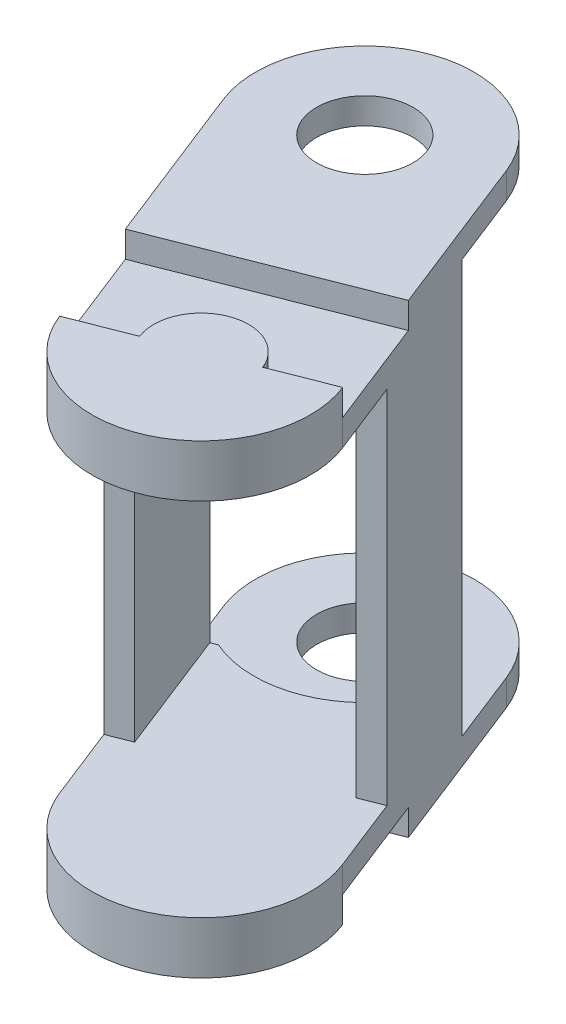
ISO-10303-21;
HEADER;
FILE_DESCRIPTION(('STEP AP214'),'2;1');
FILE_NAME('part.step','',(''),(''),'','','');
FILE_SCHEMA(('AUTOMOTIVE_DESIGN { 1 0 10303 214 1 1 1 1 }'));
ENDSEC;
DATA;
#1=APPLICATION_CONTEXT('core data for automotive mechanical design processes');
#2=APPLICATION_PROTOCOL_DEFINITION('international standard','automotive_design',2000,#1);
#3=PRODUCT_CONTEXT('',#1,'mechanical');
#4=PRODUCT('Part','Part','',(#3));
#5=PRODUCT_RELATED_PRODUCT_CATEGORY('part','',(#4));
#6=PRODUCT_DEFINITION_FORMATION('','',#4);
#7=PRODUCT_DEFINITION_CONTEXT('part definition',#1,'design');
#8=PRODUCT_DEFINITION('design','',#6,#7);
#9=PRODUCT_DEFINITION_SHAPE('','',#8);
#10=(LENGTH_UNIT() NAMED_UNIT(*) SI_UNIT(.MILLI.,.METRE.));
#11=(NAMED_UNIT(*) PLANE_ANGLE_UNIT() SI_UNIT($,.RADIAN.));
#12=(NAMED_UNIT(*) SI_UNIT($,.STERADIAN.) SOLID_ANGLE_UNIT());
#13=UNCERTAINTY_MEASURE_WITH_UNIT(LENGTH_MEASURE(1.E-05),#10,'distance_accuracy_value','');
#14=(GEOMETRIC_REPRESENTATION_CONTEXT(3) GLOBAL_UNCERTAINTY_ASSIGNED_CONTEXT((#13)) GLOBAL_UNIT_ASSIGNED_CONTEXT((#10,
#11,#12)) REPRESENTATION_CONTEXT('',''));
#15=CARTESIAN_POINT('',(0.,0.,0.));
#16=DIRECTION('',(0.,0.,1.));
#17=DIRECTION('',(1.,0.,0.));
#18=AXIS2_PLACEMENT_3D('',#15,#16,#17);
#19=CARTESIAN_POINT('',(-184.265930697306,43.5,61.1855100411605));
#20=DIRECTION('',(0.365652358002226,0.,0.930751499105648));
#21=DIRECTION('',(0.930751499105649,0.,-0.365652358002226));
#22=AXIS2_PLACEMENT_3D('',#19,#20,#21);
#23=PLANE('',#22);
#24=DIRECTION('',(0.930751499105648,0.,-0.365652358002226));
#25=VECTOR('',#24,1.);
#26=CARTESIAN_POINT('',(-184.265930697306,40.75,61.1855100411605));
#27=LINE('',#26,#25);
#28=CARTESIAN_POINT('',(-156.074627033272,40.75,50.1103555344892));
#29=VERTEX_POINT('',#28);
#30=CARTESIAN_POINT('',(-150.024742289085,40.75,47.7336152074748));
#31=VERTEX_POINT('',#30);
#32=EDGE_CURVE('E271',#29,#31,#27,.T.);
#33=ORIENTED_EDGE('',*,*,#32,.F.);
#34=DIRECTION('',(0.,1.,0.));
#35=VECTOR('',#34,1.);
#36=CARTESIAN_POINT('',(-156.074627033272,40.75,50.1103555344892));
#37=LINE('',#36,#35);
#38=CARTESIAN_POINT('',(-156.074627033272,43.5,50.1103555344892));
#39=VERTEX_POINT('',#38);
#40=EDGE_CURVE('E65',#29,#39,#37,.T.);
#41=ORIENTED_EDGE('',*,*,#40,.T.);
#42=DIRECTION('',(-0.930751499105649,0.,0.365652358002226));
#43=VECTOR('',#42,1.);
#44=CARTESIAN_POINT('',(-160.728384528823,43.5,51.9386173245095));
#45=LINE('',#44,#43);
#46=CARTESIAN_POINT('',(-150.024742289085,43.5,47.7336152074748));
#47=VERTEX_POINT('',#46);
#48=EDGE_CURVE('E12',#47,#39,#45,.T.);
#49=ORIENTED_EDGE('',*,*,#48,.F.);
#50=DIRECTION('',(0.,-1.,0.));
#51=VECTOR('',#50,1.);
#52=CARTESIAN_POINT('',(-150.024742289085,43.5,47.7336152074748));
#53=LINE('',#52,#51);
#54=EDGE_CURVE('E1078',#47,#31,#53,.T.);
#55=ORIENTED_EDGE('',*,*,#54,.T.);
#56=EDGE_LOOP('',(#33,#41,#49,#55));
#57=FACE_BOUND('',#56,.T.);
#58=ADVANCED_FACE('F50',(#57),#23,.F.);
#59=CARTESIAN_POINT('',(-184.265930697343,-2.75,61.1855100410671));
#60=DIRECTION('',(0.365652358002226,0.,0.930751499105649));
#61=DIRECTION('',(0.930751499105649,0.,-0.365652358002226));
#62=AXIS2_PLACEMENT_3D('',#59,#60,#61);
#63=PLANE('',#62);
#64=DIRECTION('',(0.930751499105649,0.,-0.365652358002226));
#65=VECTOR('',#64,1.);
#66=CARTESIAN_POINT('',(-160.728384528813,-5.5,51.9386173243977));
#67=LINE('',#66,#65);
#68=CARTESIAN_POINT('',(-156.074627033308,-5.5,50.1103555343957));
#69=VERTEX_POINT('',#68);
#70=CARTESIAN_POINT('',(-150.024742289129,-5.5,47.7336152073636));
#71=VERTEX_POINT('',#70);
#72=EDGE_CURVE('E451',#69,#71,#67,.T.);
#73=ORIENTED_EDGE('',*,*,#72,.F.);
#74=DIRECTION('',(0.,1.,0.));
#75=VECTOR('',#74,1.);
#76=CARTESIAN_POINT('',(-156.074627033308,-5.5,50.1103555343957));
#77=LINE('',#76,#75);
#78=CARTESIAN_POINT('',(-156.074627033308,-2.75,50.1103555343957));
#79=VERTEX_POINT('',#78);
#80=EDGE_CURVE('E1084',#69,#79,#77,.T.);
#81=ORIENTED_EDGE('',*,*,#80,.T.);
#82=DIRECTION('',(0.930751499105649,0.,-0.365652358002226));
#83=VECTOR('',#82,1.);
#84=CARTESIAN_POINT('',(-184.265930697343,-2.75,61.1855100410671));
#85=LINE('',#84,#83);
#86=CARTESIAN_POINT('',(-150.024742289122,-2.75,47.7336152073813));
#87=VERTEX_POINT('',#86);
#88=EDGE_CURVE('E294',#79,#87,#85,.T.);
#89=ORIENTED_EDGE('',*,*,#88,.T.);
#90=DIRECTION('',(0.,1.,0.));
#91=VECTOR('',#90,1.);
#92=CARTESIAN_POINT('',(-150.024742289222,-2.75,47.7336152074002));
#93=LINE('',#92,#91);
#94=EDGE_CURVE('E423',#71,#87,#93,.T.);
#95=ORIENTED_EDGE('',*,*,#94,.F.);
#96=EDGE_LOOP('',(#73,#81,#89,#95));
#97=FACE_BOUND('',#96,.T.);
#98=ADVANCED_FACE('F1148',(#97),#63,.F.);
#99=CARTESIAN_POINT('',(-160.72838452886,43.5,51.938617324416));
#100=DIRECTION('',(0.,-1.,0.));
#101=DIRECTION('',(0.,0.,-1.));
#102=AXIS2_PLACEMENT_3D('',#99,#100,#101);
#103=PLANE('',#102);
#104=ORIENTED_EDGE('',*,*,#48,.T.);
#105=CARTESIAN_POINT('',(-160.7283845288,43.5,51.9386173245));
#106=DIRECTION('',(0.,1.,0.));
#107=DIRECTION('',(0.,0.,1.));
#108=AXIS2_PLACEMENT_3D('',#105,#106,#107);
#109=CIRCLE('',#108,5.);
#110=CARTESIAN_POINT('',(-165.382142024328,43.5,53.7668791145114));
#111=VERTEX_POINT('',#110);
#112=EDGE_CURVE('E256',#39,#111,#109,.T.);
#113=ORIENTED_EDGE('',*,*,#112,.T.);
#114=CARTESIAN_POINT('',(-171.432026768515,43.5,56.143619441526));
#115=VERTEX_POINT('',#114);
#116=EDGE_CURVE('E58',#111,#115,#45,.T.);
#117=ORIENTED_EDGE('',*,*,#116,.T.);
#118=CARTESIAN_POINT('',(-160.72838452886,43.5,51.938617324416));
#119=DIRECTION('',(0.,1.,0.));
#120=DIRECTION('',(0.,0.,-1.));
#121=AXIS2_PLACEMENT_3D('',#118,#119,#120);
#122=CIRCLE('',#121,11.499999999975);
#123=EDGE_CURVE('E427',#115,#47,#122,.T.);
#124=ORIENTED_EDGE('',*,*,#123,.T.);
#125=EDGE_LOOP('',(#104,#113,#117,#124));
#126=FACE_BOUND('',#125,.T.);
#127=ADVANCED_FACE('F1070',(#126),#103,.F.);
#128=CARTESIAN_POINT('',(-160.72838452882,-5.5,51.9386173243801));
#129=DIRECTION('',(0.,1.,0.));
#130=DIRECTION('',(0.,0.,1.));
#131=AXIS2_PLACEMENT_3D('',#128,#129,#130);
#132=PLANE('',#131);
#133=CARTESIAN_POINT('',(-171.8807814485,-5.5,23.5506966021));
#134=DIRECTION('',(0.,-1.,0.));
#135=DIRECTION('',(0.,0.,-1.));
#136=AXIS2_PLACEMENT_3D('',#133,#134,#135);
#137=CIRCLE('',#136,5.07500000000002);
#138=CARTESIAN_POINT('',(-171.8807814485,-5.5,18.4756966021));
#139=VERTEX_POINT('',#138);
#140=EDGE_CURVE('E1640',#139,#139,#137,.T.);
#141=ORIENTED_EDGE('',*,*,#140,.F.);
#142=EDGE_LOOP('',(#141));
#143=FACE_BOUND('',#142,.T.);
#144=DIRECTION('',(0.365652358002226,0.,0.930751499105648));
#145=VECTOR('',#144,1.);
#146=CARTESIAN_POINT('',(-150.024742289129,-5.5,47.7336152073636));
#147=LINE('',#146,#145);
#148=CARTESIAN_POINT('',(-161.177139208116,-5.5,19.3456944848454));
#149=VERTEX_POINT('',#148);
#150=CARTESIAN_POINT('',(-154.503983674491,-5.5,36.3319093437392));
#151=VERTEX_POINT('',#150);
#152=EDGE_CURVE('E317',#149,#151,#147,.T.);
#153=ORIENTED_EDGE('',*,*,#152,.T.);
#154=DIRECTION('',(-0.930751499105649,0.,0.365652358002226));
#155=VECTOR('',#154,1.);
#156=CARTESIAN_POINT('',(-165.207625914183,-5.5,40.5369114607557));
#157=LINE('',#156,#155);
#158=CARTESIAN_POINT('',(-175.911268153856,-5.5,44.7419135777648));
#159=VERTEX_POINT('',#158);
#160=EDGE_CURVE('E1063',#151,#159,#157,.T.);
#161=ORIENTED_EDGE('',*,*,#160,.T.);
#162=DIRECTION('',(-0.365652358000698,0.,-0.930751499106249));
#163=VECTOR('',#162,1.);
#164=CARTESIAN_POINT('',(-182.58442368746,-5.5,27.7556987188424));
#165=LINE('',#164,#163);
#166=CARTESIAN_POINT('',(-182.58442368746,-5.5,27.7556987188424));
#167=VERTEX_POINT('',#166);
#168=EDGE_CURVE('E312',#159,#167,#165,.T.);
#169=ORIENTED_EDGE('',*,*,#168,.T.);
#170=CARTESIAN_POINT('',(-171.880781447785,-5.5,23.5506966018527));
#171=DIRECTION('',(0.,-1.,0.));
#172=DIRECTION('',(0.,0.,1.));
#173=AXIS2_PLACEMENT_3D('',#170,#171,#172);
#174=CIRCLE('',#173,11.49999999995);
#175=EDGE_CURVE('E315',#167,#149,#174,.T.);
#176=ORIENTED_EDGE('',*,*,#175,.T.);
#177=EDGE_LOOP('',(#153,#161,#169,#176));
#178=FACE_BOUND('',#177,.T.);
#179=ADVANCED_FACE('F1140',(#143,#178),#132,.F.);
#180=CARTESIAN_POINT('',(-11.9490681605092,0.,-30.4158112478024));
#181=DIRECTION('',(-0.365652358002225,0.,-0.930751499105649));
#182=DIRECTION('',(-0.930751499105649,0.,0.365652358002225));
#183=AXIS2_PLACEMENT_3D('',#180,#181,#182);
#184=PLANE('',#183);
#185=DIRECTION('',(0.,1.,0.));
#186=VECTOR('',#185,1.);
#187=CARTESIAN_POINT('',(-176.585881805809,-2.75,34.2629340254768));
#188=LINE('',#187,#186);
#189=CARTESIAN_POINT('',(-176.585881805809,-2.75,34.2629340254768));
#190=VERTEX_POINT('',#189);
#191=CARTESIAN_POINT('',(-176.585881805809,0.,34.2629340254768));
#192=VERTEX_POINT('',#191);
#193=EDGE_CURVE('E304',#190,#192,#188,.T.);
#194=ORIENTED_EDGE('',*,*,#193,.F.);
#195=DIRECTION('',(-0.930751499105649,0.,0.365652358002225));
#196=VECTOR('',#195,1.);
#197=CARTESIAN_POINT('',(-158.160507254501,-2.75,27.0243943527135));
#198=LINE('',#197,#196);
#199=CARTESIAN_POINT('',(-179.567791733931,-2.75,35.4343985867648));
#200=VERTEX_POINT('',#199);
#201=EDGE_CURVE('E396',#190,#200,#198,.T.);
#202=ORIENTED_EDGE('',*,*,#201,.T.);
#203=DIRECTION('',(0.,1.,0.));
#204=VECTOR('',#203,1.);
#205=CARTESIAN_POINT('',(-179.567791733931,-2.75,35.4343985867648));
#206=LINE('',#205,#204);
#207=CARTESIAN_POINT('',(-179.567791733931,40.75,35.4343985867648));
#208=VERTEX_POINT('',#207);
#209=EDGE_CURVE('E402',#200,#208,#206,.T.);
#210=ORIENTED_EDGE('',*,*,#209,.T.);
#211=DIRECTION('',(0.930751499105649,0.,-0.365652358002225));
#212=VECTOR('',#211,1.);
#213=CARTESIAN_POINT('',(-179.567791733931,40.75,35.4343985867648));
#214=LINE('',#213,#212);
#215=CARTESIAN_POINT('',(-176.585881805809,40.75,34.2629340254766));
#216=VERTEX_POINT('',#215);
#217=EDGE_CURVE('E406',#208,#216,#214,.T.);
#218=ORIENTED_EDGE('',*,*,#217,.T.);
#219=DIRECTION('',(0.,1.,0.));
#220=VECTOR('',#219,1.);
#221=CARTESIAN_POINT('',(-176.585881805809,38.,34.2629340254768));
#222=LINE('',#221,#220);
#223=CARTESIAN_POINT('',(-176.585881805809,38.0000000000003,34.2629340254769));
#224=VERTEX_POINT('',#223);
#225=EDGE_CURVE('E393',#224,#216,#222,.T.);
#226=ORIENTED_EDGE('',*,*,#225,.F.);
#227=DIRECTION('',(0.930751499105649,0.,-0.365652358002225));
#228=VECTOR('',#227,1.);
#229=CARTESIAN_POINT('',(-177.240912986167,38.0000000000003,34.5202676917593));
#230=LINE('',#229,#228);
#231=CARTESIAN_POINT('',(-177.240912986167,38.0000000000003,34.5202676917593));
#232=VERTEX_POINT('',#231);
#233=EDGE_CURVE('E355',#232,#224,#230,.T.);
#234=ORIENTED_EDGE('',*,*,#233,.F.);
#235=DIRECTION('',(0.,1.,0.));
#236=VECTOR('',#235,1.);
#237=CARTESIAN_POINT('',(-177.240912986166,2.74925928360182E-13,34.5202676917592));
#238=LINE('',#237,#236);
#239=CARTESIAN_POINT('',(-177.240912986166,2.74925928360182E-13,34.5202676917592));
#240=VERTEX_POINT('',#239);
#241=EDGE_CURVE('E347',#240,#232,#238,.T.);
#242=ORIENTED_EDGE('',*,*,#241,.F.);
#243=DIRECTION('',(0.930751499105649,0.,-0.365652358002226));
#244=VECTOR('',#243,1.);
#245=CARTESIAN_POINT('',(-176.585881805809,0.,34.2629340254767));
#246=LINE('',#245,#244);
#247=EDGE_CURVE('E384',#240,#192,#246,.T.);
#248=ORIENTED_EDGE('',*,*,#247,.T.);
#249=EDGE_LOOP('',(#194,#202,#210,#218,#226,#234,#242,#248));
#250=FACE_BOUND('',#249,.T.);
#251=ADVANCED_FACE('F1209',(#250),#184,.T.);
#252=CARTESIAN_POINT('',(-6.82993515371631,0.,-17.3852902704244));
#253=DIRECTION('',(0.365652358061123,0.,0.93075149908251));
#254=DIRECTION('',(0.93075149908251,0.,-0.365652358061123));
#255=AXIS2_PLACEMENT_3D('',#252,#253,#254);
#256=PLANE('',#255);
#257=DIRECTION('',(-0.93075149908251,0.,0.365652358061123));
#258=VECTOR('',#257,1.);
#259=CARTESIAN_POINT('',(-153.041374243652,38.,40.0549153391781));
#260=LINE('',#259,#258);
#261=CARTESIAN_POINT('',(-153.041374243652,38.,40.0549153391781));
#262=VERTEX_POINT('',#261);
#263=CARTESIAN_POINT('',(-155.368252990242,38.0000000000002,40.9690462351789));
#264=VERTEX_POINT('',#263);
#265=EDGE_CURVE('E373',#262,#264,#260,.T.);
#266=ORIENTED_EDGE('',*,*,#265,.T.);
#267=DIRECTION('',(0.,1.,0.));
#268=VECTOR('',#267,1.);
#269=CARTESIAN_POINT('',(-155.368252990242,2.51062781034005E-13,40.9690462351788));
#270=LINE('',#269,#268);
#271=CARTESIAN_POINT('',(-155.36825299068,0.,40.9690462340644));
#272=VERTEX_POINT('',#271);
#273=EDGE_CURVE('E339',#272,#264,#270,.T.);
#274=ORIENTED_EDGE('',*,*,#273,.F.);
#275=DIRECTION('',(0.93075149908251,0.,-0.365652358061123));
#276=VECTOR('',#275,1.);
#277=CARTESIAN_POINT('',(-156.023284171507,0.,41.2263799005793));
#278=LINE('',#277,#276);
#279=CARTESIAN_POINT('',(-153.041374243652,0.,40.0549153391781));
#280=VERTEX_POINT('',#279);
#281=EDGE_CURVE('E376',#272,#280,#278,.T.);
#282=ORIENTED_EDGE('',*,*,#281,.T.);
#283=DIRECTION('',(0.,1.,0.));
#284=VECTOR('',#283,1.);
#285=CARTESIAN_POINT('',(-153.041374243652,0.,40.0549153391781));
#286=LINE('',#285,#284);
#287=EDGE_CURVE('E368',#280,#262,#286,.T.);
#288=ORIENTED_EDGE('',*,*,#287,.T.);
#289=EDGE_LOOP('',(#266,#274,#282,#288));
#290=FACE_BOUND('',#289,.T.);
#291=ADVANCED_FACE('F1205',(#290),#256,.T.);
#292=CARTESIAN_POINT('',(-6.82993515375245,0.,-17.3852902705165));
#293=DIRECTION('',(0.36565235806112,0.,0.930751499082512));
#294=DIRECTION('',(0.930751499082512,0.,-0.36565235806112));
#295=AXIS2_PLACEMENT_3D('',#292,#293,#294);
#296=PLANE('',#295);
#297=DIRECTION('',(0.930751499082512,0.,-0.36565235806112));
#298=VECTOR('',#297,1.);
#299=CARTESIAN_POINT('',(-174.448658722586,0.,48.4649195744912));
#300=LINE('',#299,#298);
#301=CARTESIAN_POINT('',(-174.448658722586,0.,48.4649195744912));
#302=VERTEX_POINT('',#301);
#303=CARTESIAN_POINT('',(-172.121779974143,2.74925928360181E-13,47.550788679219));
#304=VERTEX_POINT('',#303);
#305=EDGE_CURVE('E360',#302,#304,#300,.T.);
#306=ORIENTED_EDGE('',*,*,#305,.T.);
#307=DIRECTION('',(0.,-1.,0.));
#308=VECTOR('',#307,1.);
#309=CARTESIAN_POINT('',(-172.121779974143,38.0000000000003,47.550788679219));
#310=LINE('',#309,#308);
#311=CARTESIAN_POINT('',(-172.121779974201,38.,47.5507886790717));
#312=VERTEX_POINT('',#311);
#313=EDGE_CURVE('E352',#312,#304,#310,.T.);
#314=ORIENTED_EDGE('',*,*,#313,.F.);
#315=DIRECTION('',(-0.930751499082512,0.,0.36565235806112));
#316=VECTOR('',#315,1.);
#317=CARTESIAN_POINT('',(-171.466748794345,38.,47.2934550129388));
#318=LINE('',#317,#316);
#319=CARTESIAN_POINT('',(-174.448658722586,38.,48.4649195744912));
#320=VERTEX_POINT('',#319);
#321=EDGE_CURVE('E363',#312,#320,#318,.T.);
#322=ORIENTED_EDGE('',*,*,#321,.T.);
#323=DIRECTION('',(0.,-1.,0.));
#324=VECTOR('',#323,1.);
#325=CARTESIAN_POINT('',(-174.448658722586,38.,48.4649195744912));
#326=LINE('',#325,#324);
#327=EDGE_CURVE('E357',#320,#302,#326,.T.);
#328=ORIENTED_EDGE('',*,*,#327,.T.);
#329=EDGE_LOOP('',(#306,#314,#322,#328));
#330=FACE_BOUND('',#329,.T.);
#331=ADVANCED_FACE('F1201',(#330),#296,.T.);
#332=DIRECTION('',(0.,1.,0.));
#333=VECTOR('',#332,1.);
#334=CARTESIAN_POINT('',(-161.142417182623,-2.75,28.1958589140017));
#335=LINE('',#334,#333);
#336=CARTESIAN_POINT('',(-161.142417182623,-2.75,28.1958589140016));
#337=VERTEX_POINT('',#336);
#338=CARTESIAN_POINT('',(-161.142417182623,0.,28.1958589140017));
#339=VERTEX_POINT('',#338);
#340=EDGE_CURVE('E302',#337,#339,#335,.T.);
#341=ORIENTED_EDGE('',*,*,#340,.T.);
#342=CARTESIAN_POINT('',(-160.487386002265,2.51062781034004E-13,27.9385252477194));
#343=VERTEX_POINT('',#342);
#344=EDGE_CURVE('E382',#339,#343,#246,.T.);
#345=ORIENTED_EDGE('',*,*,#344,.T.);
#346=DIRECTION('',(0.,-1.,0.));
#347=VECTOR('',#346,1.);
#348=CARTESIAN_POINT('',(-160.487386002265,38.0000000000002,27.9385252477194));
#349=LINE('',#348,#347);
#350=CARTESIAN_POINT('',(-160.487386002265,38.0000000000002,27.9385252477194));
#351=VERTEX_POINT('',#350);
#352=EDGE_CURVE('E334',#351,#343,#349,.T.);
#353=ORIENTED_EDGE('',*,*,#352,.F.);
#354=DIRECTION('',(-0.930751499105649,0.,0.365652358002225));
#355=VECTOR('',#354,1.);
#356=CARTESIAN_POINT('',(-160.487386002265,38.0000000000002,27.9385252477194));
#357=LINE('',#356,#355);
#358=CARTESIAN_POINT('',(-161.142417182623,38.0000000000002,28.1958589140019));
#359=VERTEX_POINT('',#358);
#360=EDGE_CURVE('E342',#351,#359,#357,.T.);
#361=ORIENTED_EDGE('',*,*,#360,.T.);
#362=DIRECTION('',(0.,1.,0.));
#363=VECTOR('',#362,1.);
#364=CARTESIAN_POINT('',(-161.142417182623,38.,28.1958589140015));
#365=LINE('',#364,#363);
#366=CARTESIAN_POINT('',(-161.142417182623,40.75,28.1958589140015));
#367=VERTEX_POINT('',#366);
#368=EDGE_CURVE('E391',#359,#367,#365,.T.);
#369=ORIENTED_EDGE('',*,*,#368,.T.);
#370=CARTESIAN_POINT('',(-158.160507254501,40.75,27.0243943527135));
#371=VERTEX_POINT('',#370);
#372=EDGE_CURVE('E405',#367,#371,#214,.T.);
#373=ORIENTED_EDGE('',*,*,#372,.T.);
#374=DIRECTION('',(0.,-1.,0.));
#375=VECTOR('',#374,1.);
#376=CARTESIAN_POINT('',(-158.160507254501,40.75,27.0243943527135));
#377=LINE('',#376,#375);
#378=CARTESIAN_POINT('',(-158.160507254501,-2.75,27.0243943527136));
#379=VERTEX_POINT('',#378);
#380=EDGE_CURVE('E409',#371,#379,#377,.T.);
#381=ORIENTED_EDGE('',*,*,#380,.T.);
#382=EDGE_CURVE('E399',#379,#337,#198,.T.);
#383=ORIENTED_EDGE('',*,*,#382,.T.);
#384=EDGE_LOOP('',(#341,#345,#353,#361,#369,#373,#381,#383));
#385=FACE_BOUND('',#384,.T.);
#386=ADVANCED_FACE('F1204',(#385),#184,.T.);
#387=CARTESIAN_POINT('',(-164.933386645826,38.,41.234975084785));
#388=DIRECTION('',(0.,1.,0.));
#389=DIRECTION('',(1.,0.,0.));
#390=AXIS2_PLACEMENT_3D('',#387,#388,#389);
#391=PLANE('',#390);
#392=CARTESIAN_POINT('',(-160.72838452893,38.,51.9386173244435));
#393=DIRECTION('',(0.,1.,0.));
#394=DIRECTION('',(0.365652358010348,0.,0.930751499102458));
#395=AXIS2_PLACEMENT_3D('',#392,#393,#394);
#396=CIRCLE('',#395,11.5);
#397=CARTESIAN_POINT('',(-171.432026768707,38.,56.1436194416015));
#398=VERTEX_POINT('',#397);
#399=CARTESIAN_POINT('',(-150.02474228981,38.,47.7336152061957));
#400=VERTEX_POINT('',#399);
#401=EDGE_CURVE('E452',#398,#400,#396,.T.);
#402=ORIENTED_EDGE('',*,*,#401,.F.);
#403=DIRECTION('',(0.365652358061124,0.,0.93075149908251));
#404=VECTOR('',#403,1.);
#405=CARTESIAN_POINT('',(-174.448658722586,38.,48.4649195744912));
#406=LINE('',#405,#404);
#407=EDGE_CURVE('E366',#320,#398,#406,.T.);
#408=ORIENTED_EDGE('',*,*,#407,.F.);
#409=ORIENTED_EDGE('',*,*,#321,.F.);
#410=DIRECTION('',(0.365652358002226,0.,0.930751499105649));
#411=VECTOR('',#410,1.);
#412=CARTESIAN_POINT('',(-177.240912986167,38.0000000000003,34.5202676917593));
#413=LINE('',#412,#411);
#414=EDGE_CURVE('E350',#232,#312,#413,.T.);
#415=ORIENTED_EDGE('',*,*,#414,.F.);
#416=ORIENTED_EDGE('',*,*,#233,.T.);
#417=CARTESIAN_POINT('',(-171.880781447868,38.,23.5506966017777));
#418=DIRECTION('',(0.,1.,0.));
#419=DIRECTION('',(0.,0.,1.));
#420=AXIS2_PLACEMENT_3D('',#417,#418,#419);
#421=CIRCLE('',#420,11.6999999999998);
#422=EDGE_CURVE('E388',#224,#359,#421,.T.);
#423=ORIENTED_EDGE('',*,*,#422,.T.);
#424=ORIENTED_EDGE('',*,*,#360,.F.);
#425=DIRECTION('',(-0.365652358002224,0.,-0.930751499105649));
#426=VECTOR('',#425,1.);
#427=CARTESIAN_POINT('',(-155.368252990242,38.0000000000002,40.9690462351789));
#428=LINE('',#427,#426);
#429=EDGE_CURVE('E331',#264,#351,#428,.T.);
#430=ORIENTED_EDGE('',*,*,#429,.F.);
#431=ORIENTED_EDGE('',*,*,#265,.F.);
#432=DIRECTION('',(0.365652358061124,0.,0.93075149908251));
#433=VECTOR('',#432,1.);
#434=CARTESIAN_POINT('',(-153.041374243652,38.,40.0549153391781));
#435=LINE('',#434,#433);
#436=EDGE_CURVE('E378',#262,#400,#435,.T.);
#437=ORIENTED_EDGE('',*,*,#436,.T.);
#438=EDGE_LOOP('',(#402,#408,#409,#415,#416,#423,#424,#430,#431,#437));
#439=FACE_BOUND('',#438,.T.);
#440=ADVANCED_FACE('F1217',(#439),#391,.F.);
#441=CARTESIAN_POINT('',(-177.008225228049,-5.5,41.9496590801645));
#442=DIRECTION('',(-0.930751499105649,0.,0.365652358002226));
#443=DIRECTION('',(0.,1.,0.));
#444=AXIS2_PLACEMENT_3D('',#441,#442,#443);
#445=PLANE('',#444);
#446=DIRECTION('',(0.,-1.,0.));
#447=VECTOR('',#446,1.);
#448=CARTESIAN_POINT('',(-175.911268153921,-5.5,44.7419135777904));
#449=LINE('',#448,#447);
#450=CARTESIAN_POINT('',(-175.911268153884,43.5,44.7419135777757));
#451=VERTEX_POINT('',#450);
#452=CARTESIAN_POINT('',(-175.911268153921,40.75,44.7419135777904));
#453=VERTEX_POINT('',#452);
#454=EDGE_CURVE('E273',#451,#453,#449,.T.);
#455=ORIENTED_EDGE('',*,*,#454,.F.);
#456=DIRECTION('',(0.365652357999172,0.,0.930751499106848));
#457=VECTOR('',#456,1.);
#458=CARTESIAN_POINT('',(-171.432026768565,43.5,56.1436194413973));
#459=LINE('',#458,#457);
#460=CARTESIAN_POINT('',(-182.584423687474,43.5,27.7556987188073));
#461=VERTEX_POINT('',#460);
#462=EDGE_CURVE('E434',#461,#451,#459,.T.);
#463=ORIENTED_EDGE('',*,*,#462,.F.);
#464=DIRECTION('',(0.,-1.,0.));
#465=VECTOR('',#464,1.);
#466=CARTESIAN_POINT('',(-182.584423687474,43.5,27.7556987188073));
#467=LINE('',#466,#465);
#468=CARTESIAN_POINT('',(-182.584423687583,40.75,27.7556987188033));
#469=VERTEX_POINT('',#468);
#470=EDGE_CURVE('E437',#461,#469,#467,.T.);
#471=ORIENTED_EDGE('',*,*,#470,.T.);
#472=DIRECTION('',(-0.365652358002225,0.,-0.930751499105649));
#473=VECTOR('',#472,1.);
#474=CARTESIAN_POINT('',(-179.567791733931,40.75,35.4343985867648));
#475=LINE('',#474,#473);
#476=EDGE_CURVE('E412',#208,#469,#475,.T.);
#477=ORIENTED_EDGE('',*,*,#476,.F.);
#478=ORIENTED_EDGE('',*,*,#209,.F.);
#479=DIRECTION('',(-0.365652358000698,0.,-0.930751499106249));
#480=VECTOR('',#479,1.);
#481=CARTESIAN_POINT('',(-182.58442368746,-2.75,27.7556987188424));
#482=LINE('',#481,#480);
#483=CARTESIAN_POINT('',(-182.58442368746,-2.75,27.7556987188424));
#484=VERTEX_POINT('',#483);
#485=EDGE_CURVE('E306',#200,#484,#482,.T.);
#486=ORIENTED_EDGE('',*,*,#485,.T.);
#487=DIRECTION('',(0.,1.,0.));
#488=VECTOR('',#487,1.);
#489=CARTESIAN_POINT('',(-182.58442368746,-5.5,27.7556987188424));
#490=LINE('',#489,#488);
#491=EDGE_CURVE('E328',#167,#484,#490,.T.);
#492=ORIENTED_EDGE('',*,*,#491,.F.);
#493=ORIENTED_EDGE('',*,*,#168,.F.);
#494=DIRECTION('',(0.,-1.,0.));
#495=VECTOR('',#494,1.);
#496=CARTESIAN_POINT('',(-175.911268153921,-5.50000000000002,44.7419135777904));
#497=LINE('',#496,#495);
#498=CARTESIAN_POINT('',(-175.911268153921,-2.75,44.7419135777904));
#499=VERTEX_POINT('',#498);
#500=EDGE_CURVE('E293',#499,#159,#497,.T.);
#501=ORIENTED_EDGE('',*,*,#500,.F.);
#502=DIRECTION('',(-0.365652358002226,0.,-0.930751499105649));
#503=VECTOR('',#502,1.);
#504=CARTESIAN_POINT('',(-177.008225228049,-2.75,41.9496590801645));
#505=LINE('',#504,#503);
#506=CARTESIAN_POINT('',(-171.432026768505,-2.75,56.1436194414142));
#507=VERTEX_POINT('',#506);
#508=EDGE_CURVE('E297',#507,#499,#505,.T.);
#509=ORIENTED_EDGE('',*,*,#508,.F.);
#510=DIRECTION('',(0.,1.,0.));
#511=VECTOR('',#510,1.);
#512=CARTESIAN_POINT('',(-171.432026768498,-2.75,56.1436194414317));
#513=LINE('',#512,#511);
#514=CARTESIAN_POINT('',(-171.432026768707,0.,56.1436194416015));
#515=VERTEX_POINT('',#514);
#516=EDGE_CURVE('E419',#507,#515,#513,.T.);
#517=ORIENTED_EDGE('',*,*,#516,.T.);
#518=DIRECTION('',(0.365652358061124,0.,0.93075149908251));
#519=VECTOR('',#518,1.);
#520=CARTESIAN_POINT('',(-174.448658722586,0.,48.4649195744912));
#521=LINE('',#520,#519);
#522=EDGE_CURVE('E365',#302,#515,#521,.T.);
#523=ORIENTED_EDGE('',*,*,#522,.F.);
#524=ORIENTED_EDGE('',*,*,#327,.F.);
#525=ORIENTED_EDGE('',*,*,#407,.T.);
#526=DIRECTION('',(0.,1.,0.));
#527=VECTOR('',#526,1.);
#528=CARTESIAN_POINT('',(-171.432026768422,-5.5,56.1436194414894));
#529=LINE('',#528,#527);
#530=CARTESIAN_POINT('',(-171.432026768608,40.75,56.1436194415626));
#531=VERTEX_POINT('',#530);
#532=EDGE_CURVE('E446',#398,#531,#529,.T.);
#533=ORIENTED_EDGE('',*,*,#532,.T.);
#534=DIRECTION('',(0.365652358002226,0.,0.930751499105649));
#535=VECTOR('',#534,1.);
#536=CARTESIAN_POINT('',(-177.008225228049,40.75,41.9496590801645));
#537=LINE('',#536,#535);
#538=EDGE_CURVE('E269',#453,#531,#537,.T.);
#539=ORIENTED_EDGE('',*,*,#538,.F.);
#540=EDGE_LOOP('',(#455,#463,#471,#477,#478,#486,#492,#493,#501,#509,#517,#523,#524,#525,#533,#539));
#541=FACE_BOUND('',#540,.T.);
#542=ADVANCED_FACE('F52',(#541),#445,.T.);
#543=CARTESIAN_POINT('',(-155.600940748619,-5.5,33.5396548461134));
#544=DIRECTION('',(0.930751499105649,0.,-0.365652358002226));
#545=DIRECTION('',(0.,-1.,0.));
#546=AXIS2_PLACEMENT_3D('',#543,#544,#545);
#547=PLANE('',#546);
#548=DIRECTION('',(0.,1.,0.));
#549=VECTOR('',#548,1.);
#550=CARTESIAN_POINT('',(-154.503983674491,40.75,36.3319093437392));
#551=LINE('',#550,#549);
#552=CARTESIAN_POINT('',(-154.503983674491,40.75,36.3319093437392));
#553=VERTEX_POINT('',#552);
#554=CARTESIAN_POINT('',(-154.503983674519,43.5,36.3319093437501));
#555=VERTEX_POINT('',#554);
#556=EDGE_CURVE('E275',#553,#555,#551,.T.);
#557=ORIENTED_EDGE('',*,*,#556,.F.);
#558=DIRECTION('',(-0.365652358002225,0.,-0.930751499105649));
#559=VECTOR('',#558,1.);
#560=CARTESIAN_POINT('',(-150.024742289085,40.75,47.7336152074748));
#561=LINE('',#560,#559);
#562=EDGE_CURVE('E1083',#31,#553,#561,.T.);
#563=ORIENTED_EDGE('',*,*,#562,.F.);
#564=DIRECTION('',(0.,1.,0.));
#565=VECTOR('',#564,1.);
#566=CARTESIAN_POINT('',(-150.024742289178,-5.5,47.7336152075113));
#567=LINE('',#566,#565);
#568=EDGE_CURVE('E445',#400,#31,#567,.T.);
#569=ORIENTED_EDGE('',*,*,#568,.F.);
#570=ORIENTED_EDGE('',*,*,#436,.F.);
#571=ORIENTED_EDGE('',*,*,#287,.F.);
#572=DIRECTION('',(0.365652358061124,0.,0.93075149908251));
#573=VECTOR('',#572,1.);
#574=CARTESIAN_POINT('',(-153.041374243652,0.,40.0549153391781));
#575=LINE('',#574,#573);
#576=CARTESIAN_POINT('',(-150.02474228981,0.,47.7336152061957));
#577=VERTEX_POINT('',#576);
#578=EDGE_CURVE('E379',#280,#577,#575,.T.);
#579=ORIENTED_EDGE('',*,*,#578,.T.);
#580=EDGE_CURVE('E422',#87,#577,#93,.T.);
#581=ORIENTED_EDGE('',*,*,#580,.F.);
#582=DIRECTION('',(0.365652358002225,0.,0.930751499105649));
#583=VECTOR('',#582,1.);
#584=CARTESIAN_POINT('',(-154.503983674491,-2.75,36.3319093437392));
#585=LINE('',#584,#583);
#586=CARTESIAN_POINT('',(-154.503983674491,-2.75,36.3319093437392));
#587=VERTEX_POINT('',#586);
#588=EDGE_CURVE('E286',#587,#87,#585,.T.);
#589=ORIENTED_EDGE('',*,*,#588,.F.);
#590=DIRECTION('',(0.,1.,0.));
#591=VECTOR('',#590,1.);
#592=CARTESIAN_POINT('',(-154.503983674491,-5.5,36.3319093437392));
#593=LINE('',#592,#591);
#594=EDGE_CURVE('E283',#151,#587,#593,.T.);
#595=ORIENTED_EDGE('',*,*,#594,.F.);
#596=ORIENTED_EDGE('',*,*,#152,.F.);
#597=DIRECTION('',(0.,1.,0.));
#598=VECTOR('',#597,1.);
#599=CARTESIAN_POINT('',(-161.177139208116,-5.5,19.3456944848454));
#600=LINE('',#599,#598);
#601=CARTESIAN_POINT('',(-161.177139208116,-2.75,19.3456944848454));
#602=VERTEX_POINT('',#601);
#603=EDGE_CURVE('E320',#149,#602,#600,.T.);
#604=ORIENTED_EDGE('',*,*,#603,.T.);
#605=DIRECTION('',(0.365652358002226,0.,0.930751499105648));
#606=VECTOR('',#605,1.);
#607=CARTESIAN_POINT('',(-150.024742289129,-2.75,47.7336152073636));
#608=LINE('',#607,#606);
#609=EDGE_CURVE('E313',#602,#379,#608,.T.);
#610=ORIENTED_EDGE('',*,*,#609,.T.);
#611=ORIENTED_EDGE('',*,*,#380,.F.);
#612=DIRECTION('',(-0.365652358002225,0.,-0.930751499105649));
#613=VECTOR('',#612,1.);
#614=CARTESIAN_POINT('',(-158.160507254501,40.75,27.0243943527135));
#615=LINE('',#614,#613);
#616=CARTESIAN_POINT('',(-161.177139208153,40.75,19.3456944847521));
#617=VERTEX_POINT('',#616);
#618=EDGE_CURVE('E413',#371,#617,#615,.T.);
#619=ORIENTED_EDGE('',*,*,#618,.T.);
#620=DIRECTION('',(0.,-1.,0.));
#621=VECTOR('',#620,1.);
#622=CARTESIAN_POINT('',(-161.177139208116,43.5,19.3456944848454));
#623=LINE('',#622,#621);
#624=CARTESIAN_POINT('',(-161.177139208116,43.5,19.3456944848454));
#625=VERTEX_POINT('',#624);
#626=EDGE_CURVE('E442',#625,#617,#623,.T.);
#627=ORIENTED_EDGE('',*,*,#626,.F.);
#628=DIRECTION('',(-0.3656523580007,0.,-0.930751499106248));
#629=VECTOR('',#628,1.);
#630=CARTESIAN_POINT('',(-161.177139208116,43.5,19.3456944848454));
#631=LINE('',#630,#629);
#632=EDGE_CURVE('E430',#555,#625,#631,.T.);
#633=ORIENTED_EDGE('',*,*,#632,.F.);
#634=EDGE_LOOP('',(#557,#563,#569,#570,#571,#579,#581,#589,#595,#596,#604,#610,#611,#619,#627,#633));
#635=FACE_BOUND('',#634,.T.);
#636=ADVANCED_FACE('F1098',(#635),#547,.T.);
#637=CARTESIAN_POINT('',(-160.72838452893,-5.5,51.9386173244435));
#638=DIRECTION('',(0.,1.,0.));
#639=DIRECTION('',(0.365652358010348,0.,0.930751499102458));
#640=AXIS2_PLACEMENT_3D('',#637,#638,#639);
#641=CYLINDRICAL_SURFACE('',#640,11.5);
#642=ORIENTED_EDGE('',*,*,#568,.T.);
#643=ORIENTED_EDGE('',*,*,#54,.F.);
#644=ORIENTED_EDGE('',*,*,#123,.F.);
#645=DIRECTION('',(0.,1.,0.));
#646=VECTOR('',#645,1.);
#647=CARTESIAN_POINT('',(-171.432026768608,-5.5,56.1436194415627));
#648=LINE('',#647,#646);
#649=EDGE_CURVE('E279',#531,#115,#648,.T.);
#650=ORIENTED_EDGE('',*,*,#649,.F.);
#651=ORIENTED_EDGE('',*,*,#532,.F.);
#652=ORIENTED_EDGE('',*,*,#401,.T.);
#653=EDGE_LOOP('',(#642,#643,#644,#650,#651,#652));
#654=FACE_BOUND('',#653,.T.);
#655=ADVANCED_FACE('F1076',(#654),#641,.T.);
#656=CARTESIAN_POINT('',(-160.72838452886,40.75,51.938617324416));
#657=DIRECTION('',(0.,-1.,0.));
#658=DIRECTION('',(0.,0.,-1.));
#659=AXIS2_PLACEMENT_3D('',#656,#657,#658);
#660=PLANE('',#659);
#661=CARTESIAN_POINT('',(-171.8807814485,40.75,23.5506966021));
#662=DIRECTION('',(0.,-1.,0.));
#663=DIRECTION('',(0.,0.,-1.));
#664=AXIS2_PLACEMENT_3D('',#661,#662,#663);
#665=CIRCLE('',#664,5.07500000000002);
#666=CARTESIAN_POINT('',(-171.8807814485,40.75,18.4756966021));
#667=VERTEX_POINT('',#666);
#668=EDGE_CURVE('E1638',#667,#667,#665,.T.);
#669=ORIENTED_EDGE('',*,*,#668,.F.);
#670=EDGE_LOOP('',(#669));
#671=FACE_BOUND('',#670,.T.);
#672=CARTESIAN_POINT('',(-171.880781447792,40.75,23.5506966018351));
#673=DIRECTION('',(0.,1.,0.));
#674=DIRECTION('',(0.,0.,-1.));
#675=AXIS2_PLACEMENT_3D('',#672,#673,#674);
#676=CIRCLE('',#675,11.49999999995);
#677=EDGE_CURVE('E426',#617,#469,#676,.T.);
#678=ORIENTED_EDGE('',*,*,#677,.F.);
#679=ORIENTED_EDGE('',*,*,#618,.F.);
#680=ORIENTED_EDGE('',*,*,#372,.F.);
#681=CARTESIAN_POINT('',(-171.880781447868,40.75,23.5506966017777));
#682=DIRECTION('',(0.,1.,0.));
#683=DIRECTION('',(0.,0.,1.));
#684=AXIS2_PLACEMENT_3D('',#681,#682,#683);
#685=CIRCLE('',#684,11.6999999999998);
#686=EDGE_CURVE('E387',#216,#367,#685,.T.);
#687=ORIENTED_EDGE('',*,*,#686,.F.);
#688=ORIENTED_EDGE('',*,*,#217,.F.);
#689=ORIENTED_EDGE('',*,*,#476,.T.);
#690=EDGE_LOOP('',(#678,#679,#680,#687,#688,#689));
#691=FACE_BOUND('',#690,.T.);
#692=ADVANCED_FACE('F1227',(#671,#691),#660,.T.);
#693=CARTESIAN_POINT('',(-171.880781447792,43.5,23.5506966018351));
#694=DIRECTION('',(0.,-1.,0.));
#695=DIRECTION('',(0.,0.,-1.));
#696=AXIS2_PLACEMENT_3D('',#693,#694,#695);
#697=CYLINDRICAL_SURFACE('',#696,11.49999999995);
#698=ORIENTED_EDGE('',*,*,#677,.T.);
#699=ORIENTED_EDGE('',*,*,#470,.F.);
#700=CARTESIAN_POINT('',(-171.880781447792,43.5,23.5506966018351));
#701=DIRECTION('',(0.,1.,0.));
#702=DIRECTION('',(0.,0.,-1.));
#703=AXIS2_PLACEMENT_3D('',#700,#701,#702);
#704=CIRCLE('',#703,11.49999999995);
#705=EDGE_CURVE('E432',#625,#461,#704,.T.);
#706=ORIENTED_EDGE('',*,*,#705,.F.);
#707=ORIENTED_EDGE('',*,*,#626,.T.);
#708=EDGE_LOOP('',(#698,#699,#706,#707));
#709=FACE_BOUND('',#708,.T.);
#710=ADVANCED_FACE('F1105',(#709),#697,.T.);
#711=CARTESIAN_POINT('',(-171.8807814485,43.5,23.5506966021));
#712=DIRECTION('',(0.,-1.,0.));
#713=DIRECTION('',(0.,0.,-1.));
#714=AXIS2_PLACEMENT_3D('',#711,#712,#713);
#715=CIRCLE('',#714,5.07500000000002);
#716=CARTESIAN_POINT('',(-171.8807814485,43.5,18.4756966021));
#717=VERTEX_POINT('',#716);
#718=EDGE_CURVE('E1635',#717,#717,#715,.T.);
#719=ORIENTED_EDGE('',*,*,#718,.T.);
#720=EDGE_LOOP('',(#719));
#721=FACE_BOUND('',#720,.T.);
#722=ORIENTED_EDGE('',*,*,#462,.T.);
#723=DIRECTION('',(0.930751499105649,0.,-0.365652358002226));
#724=VECTOR('',#723,1.);
#725=CARTESIAN_POINT('',(-165.207625914229,43.5,40.5369114607739));
#726=LINE('',#725,#724);
#727=EDGE_CURVE('E1065',#451,#555,#726,.T.);
#728=ORIENTED_EDGE('',*,*,#727,.T.);
#729=ORIENTED_EDGE('',*,*,#632,.T.);
#730=ORIENTED_EDGE('',*,*,#705,.T.);
#731=EDGE_LOOP('',(#722,#728,#729,#730));
#732=FACE_BOUND('',#731,.T.);
#733=ADVANCED_FACE('F1101',(#721,#732),#103,.F.);
#734=CARTESIAN_POINT('',(-160.72838452886,-2.75,51.938617324416));
#735=DIRECTION('',(0.,1.,0.));
#736=DIRECTION('',(0.,0.,1.));
#737=AXIS2_PLACEMENT_3D('',#734,#735,#736);
#738=CYLINDRICAL_SURFACE('',#737,11.4999999999251);
#739=CARTESIAN_POINT('',(-160.72838452886,0.,51.938617324416));
#740=DIRECTION('',(0.,-1.,0.));
#741=DIRECTION('',(0.,0.,1.));
#742=AXIS2_PLACEMENT_3D('',#739,#740,#741);
#743=CIRCLE('',#742,11.4999999999251);
#744=EDGE_CURVE('E415',#577,#515,#743,.T.);
#745=ORIENTED_EDGE('',*,*,#744,.T.);
#746=ORIENTED_EDGE('',*,*,#516,.F.);
#747=CARTESIAN_POINT('',(-171.432026768505,-5.5,56.1436194414142));
#748=VERTEX_POINT('',#747);
#749=EDGE_CURVE('E420',#748,#507,#513,.T.);
#750=ORIENTED_EDGE('',*,*,#749,.F.);
#751=CARTESIAN_POINT('',(-160.72838452882,-5.5,51.9386173243801));
#752=DIRECTION('',(0.,-1.,0.));
#753=DIRECTION('',(0.,0.,1.));
#754=AXIS2_PLACEMENT_3D('',#751,#752,#753);
#755=CIRCLE('',#754,11.499999999975);
#756=EDGE_CURVE('E309',#71,#748,#755,.T.);
#757=ORIENTED_EDGE('',*,*,#756,.F.);
#758=ORIENTED_EDGE('',*,*,#94,.T.);
#759=ORIENTED_EDGE('',*,*,#580,.T.);
#760=EDGE_LOOP('',(#745,#746,#750,#757,#758,#759));
#761=FACE_BOUND('',#760,.T.);
#762=ADVANCED_FACE('F1125',(#761),#738,.T.);
#763=CARTESIAN_POINT('',(-160.72838452886,0.,51.938617324416));
#764=DIRECTION('',(0.,1.,0.));
#765=DIRECTION('',(0.,0.,1.));
#766=AXIS2_PLACEMENT_3D('',#763,#764,#765);
#767=PLANE('',#766);
#768=CARTESIAN_POINT('',(-171.880781447868,0.,23.5506966017777));
#769=DIRECTION('',(0.,1.,0.));
#770=DIRECTION('',(0.,0.,1.));
#771=AXIS2_PLACEMENT_3D('',#768,#769,#770);
#772=CIRCLE('',#771,11.6999999999999);
#773=EDGE_CURVE('E299',#192,#339,#772,.T.);
#774=ORIENTED_EDGE('',*,*,#773,.F.);
#775=ORIENTED_EDGE('',*,*,#247,.F.);
#776=DIRECTION('',(-0.365652358002224,0.,-0.930751499105649));
#777=VECTOR('',#776,1.);
#778=CARTESIAN_POINT('',(-172.121779974143,2.74925928360181E-13,47.550788679219));
#779=LINE('',#778,#777);
#780=EDGE_CURVE('E344',#304,#240,#779,.T.);
#781=ORIENTED_EDGE('',*,*,#780,.F.);
#782=ORIENTED_EDGE('',*,*,#305,.F.);
#783=ORIENTED_EDGE('',*,*,#522,.T.);
#784=ORIENTED_EDGE('',*,*,#744,.F.);
#785=ORIENTED_EDGE('',*,*,#578,.F.);
#786=ORIENTED_EDGE('',*,*,#281,.F.);
#787=DIRECTION('',(0.365652358002224,0.,0.930751499105649));
#788=VECTOR('',#787,1.);
#789=CARTESIAN_POINT('',(-160.487386002265,2.51062781034004E-13,27.9385252477194));
#790=LINE('',#789,#788);
#791=EDGE_CURVE('E337',#343,#272,#790,.T.);
#792=ORIENTED_EDGE('',*,*,#791,.F.);
#793=ORIENTED_EDGE('',*,*,#344,.F.);
#794=EDGE_LOOP('',(#774,#775,#781,#782,#783,#784,#785,#786,#792,#793));
#795=FACE_BOUND('',#794,.T.);
#796=ADVANCED_FACE('F1213',(#795),#767,.T.);
#797=CARTESIAN_POINT('',(-171.880781447868,38.,23.5506966017777));
#798=DIRECTION('',(0.,1.,0.));
#799=DIRECTION('',(0.,0.,1.));
#800=AXIS2_PLACEMENT_3D('',#797,#798,#799);
#801=CYLINDRICAL_SURFACE('',#800,11.6999999999998);
#802=ORIENTED_EDGE('',*,*,#686,.T.);
#803=ORIENTED_EDGE('',*,*,#368,.F.);
#804=ORIENTED_EDGE('',*,*,#422,.F.);
#805=ORIENTED_EDGE('',*,*,#225,.T.);
#806=EDGE_LOOP('',(#802,#803,#804,#805));
#807=FACE_BOUND('',#806,.T.);
#808=ADVANCED_FACE('F1199',(#807),#801,.F.);
#809=CARTESIAN_POINT('',(-165.291844825657,-2.88756986903428E-13,64.9360789395612));
#810=DIRECTION('',(0.930751499105649,0.,-0.365652358002224));
#811=DIRECTION('',(-0.365652358002224,0.,-0.930751499105649));
#812=AXIS2_PLACEMENT_3D('',#809,#810,#811);
#813=PLANE('',#812);
#814=ORIENTED_EDGE('',*,*,#780,.T.);
#815=ORIENTED_EDGE('',*,*,#241,.T.);
#816=ORIENTED_EDGE('',*,*,#414,.T.);
#817=ORIENTED_EDGE('',*,*,#313,.T.);
#818=EDGE_LOOP('',(#814,#815,#816,#817));
#819=FACE_BOUND('',#818,.T.);
#820=ADVANCED_FACE('F1195',(#819),#813,.T.);
#821=CARTESIAN_POINT('',(-148.538317841756,-2.43690903303847E-13,58.3543364955213));
#822=DIRECTION('',(-0.930751499105649,0.,0.365652358002224));
#823=DIRECTION('',(0.365652358002224,0.,0.930751499105649));
#824=AXIS2_PLACEMENT_3D('',#821,#822,#823);
#825=PLANE('',#824);
#826=ORIENTED_EDGE('',*,*,#429,.T.);
#827=ORIENTED_EDGE('',*,*,#352,.T.);
#828=ORIENTED_EDGE('',*,*,#791,.T.);
#829=ORIENTED_EDGE('',*,*,#273,.T.);
#830=EDGE_LOOP('',(#826,#827,#828,#829));
#831=FACE_BOUND('',#830,.T.);
#832=ADVANCED_FACE('F1188',(#831),#825,.T.);
#833=CARTESIAN_POINT('',(-160.72838452882,-2.75,51.9386173243801));
#834=DIRECTION('',(0.,1.,0.));
#835=DIRECTION('',(0.,0.,1.));
#836=AXIS2_PLACEMENT_3D('',#833,#834,#835);
#837=PLANE('',#836);
#838=CARTESIAN_POINT('',(-171.8807814485,-2.75,23.5506966021));
#839=DIRECTION('',(0.,1.,0.));
#840=DIRECTION('',(0.,0.,1.));
#841=AXIS2_PLACEMENT_3D('',#838,#839,#840);
#842=CIRCLE('',#841,5.07500000000002);
#843=CARTESIAN_POINT('',(-171.8807814485,-2.75,28.6256966021));
#844=VERTEX_POINT('',#843);
#845=EDGE_CURVE('E1645',#844,#844,#842,.T.);
#846=ORIENTED_EDGE('',*,*,#845,.F.);
#847=EDGE_LOOP('',(#846));
#848=FACE_BOUND('',#847,.T.);
#849=ORIENTED_EDGE('',*,*,#382,.F.);
#850=ORIENTED_EDGE('',*,*,#609,.F.);
#851=CARTESIAN_POINT('',(-171.880781447785,-2.75,23.5506966018527));
#852=DIRECTION('',(0.,-1.,0.));
#853=DIRECTION('',(0.,0.,1.));
#854=AXIS2_PLACEMENT_3D('',#851,#852,#853);
#855=CIRCLE('',#854,11.49999999995);
#856=EDGE_CURVE('E322',#484,#602,#855,.T.);
#857=ORIENTED_EDGE('',*,*,#856,.F.);
#858=ORIENTED_EDGE('',*,*,#485,.F.);
#859=ORIENTED_EDGE('',*,*,#201,.F.);
#860=CARTESIAN_POINT('',(-171.880781447868,-2.75,23.5506966017777));
#861=DIRECTION('',(0.,1.,0.));
#862=DIRECTION('',(0.,0.,1.));
#863=AXIS2_PLACEMENT_3D('',#860,#861,#862);
#864=CIRCLE('',#863,11.6999999999999);
#865=EDGE_CURVE('E300',#190,#337,#864,.T.);
#866=ORIENTED_EDGE('',*,*,#865,.T.);
#867=EDGE_LOOP('',(#849,#850,#857,#858,#859,#866));
#868=FACE_BOUND('',#867,.T.);
#869=ADVANCED_FACE('F1185',(#848,#868),#837,.T.);
#870=CARTESIAN_POINT('',(-171.880781447785,-5.5,23.5506966018527));
#871=DIRECTION('',(0.,1.,0.));
#872=DIRECTION('',(0.,0.,1.));
#873=AXIS2_PLACEMENT_3D('',#870,#871,#872);
#874=CYLINDRICAL_SURFACE('',#873,11.49999999995);
#875=ORIENTED_EDGE('',*,*,#856,.T.);
#876=ORIENTED_EDGE('',*,*,#603,.F.);
#877=ORIENTED_EDGE('',*,*,#175,.F.);
#878=ORIENTED_EDGE('',*,*,#491,.T.);
#879=EDGE_LOOP('',(#875,#876,#877,#878));
#880=FACE_BOUND('',#879,.T.);
#881=ADVANCED_FACE('F1184',(#880),#874,.T.);
#882=CARTESIAN_POINT('',(-165.382142024365,-5.5,53.7668791144179));
#883=VERTEX_POINT('',#882);
#884=EDGE_CURVE('E476',#748,#883,#67,.T.);
#885=ORIENTED_EDGE('',*,*,#884,.T.);
#886=CARTESIAN_POINT('',(-160.7283845288,-5.5,51.9386173245));
#887=DIRECTION('',(0.,1.,0.));
#888=DIRECTION('',(0.,0.,1.));
#889=AXIS2_PLACEMENT_3D('',#886,#887,#888);
#890=CIRCLE('',#889,5.);
#891=EDGE_CURVE('E1111',#69,#883,#890,.T.);
#892=ORIENTED_EDGE('',*,*,#891,.F.);
#893=ORIENTED_EDGE('',*,*,#72,.T.);
#894=ORIENTED_EDGE('',*,*,#756,.T.);
#895=EDGE_LOOP('',(#885,#892,#893,#894));
#896=FACE_BOUND('',#895,.T.);
#897=ADVANCED_FACE('F1120',(#896),#132,.F.);
#898=CARTESIAN_POINT('',(-171.880781447868,-2.75,23.5506966017777));
#899=DIRECTION('',(0.,1.,0.));
#900=DIRECTION('',(0.,0.,1.));
#901=AXIS2_PLACEMENT_3D('',#898,#899,#900);
#902=CYLINDRICAL_SURFACE('',#901,11.6999999999999);
#903=ORIENTED_EDGE('',*,*,#773,.T.);
#904=ORIENTED_EDGE('',*,*,#340,.F.);
#905=ORIENTED_EDGE('',*,*,#865,.F.);
#906=ORIENTED_EDGE('',*,*,#193,.T.);
#907=EDGE_LOOP('',(#903,#904,#905,#906));
#908=FACE_BOUND('',#907,.T.);
#909=ADVANCED_FACE('F1178',(#908),#902,.F.);
#910=CARTESIAN_POINT('',(-165.382142024365,-2.75,53.766879114418));
#911=VERTEX_POINT('',#910);
#912=EDGE_CURVE('E290',#507,#911,#85,.T.);
#913=ORIENTED_EDGE('',*,*,#912,.T.);
#914=DIRECTION('',(0.,1.,0.));
#915=VECTOR('',#914,1.);
#916=CARTESIAN_POINT('',(-165.382142024365,-5.5,53.7668791144179));
#917=LINE('',#916,#915);
#918=EDGE_CURVE('E73',#911,#883,#917,.F.);
#919=ORIENTED_EDGE('',*,*,#918,.T.);
#920=ORIENTED_EDGE('',*,*,#884,.F.);
#921=ORIENTED_EDGE('',*,*,#749,.T.);
#922=EDGE_LOOP('',(#913,#919,#920,#921));
#923=FACE_BOUND('',#922,.T.);
#924=ADVANCED_FACE('F1115',(#923),#63,.F.);
#925=CARTESIAN_POINT('',(-188.745172082712,-5.5,49.783804177425));
#926=DIRECTION('',(-0.365652358002226,0.,-0.930751499105649));
#927=DIRECTION('',(-0.930751499105649,0.,0.365652358002226));
#928=AXIS2_PLACEMENT_3D('',#925,#926,#927);
#929=PLANE('',#928);
#930=ORIENTED_EDGE('',*,*,#500,.T.);
#931=ORIENTED_EDGE('',*,*,#160,.F.);
#932=ORIENTED_EDGE('',*,*,#594,.T.);
#933=DIRECTION('',(0.930751499105649,0.,-0.365652358002226));
#934=VECTOR('',#933,1.);
#935=CARTESIAN_POINT('',(-188.745172082712,-2.75,49.783804177425));
#936=LINE('',#935,#934);
#937=EDGE_CURVE('E289',#499,#587,#936,.T.);
#938=ORIENTED_EDGE('',*,*,#937,.F.);
#939=EDGE_LOOP('',(#930,#931,#932,#938));
#940=FACE_BOUND('',#939,.T.);
#941=ADVANCED_FACE('F1137',(#940),#929,.F.);
#942=CARTESIAN_POINT('',(-188.745172082712,-2.75,49.783804177425));
#943=DIRECTION('',(0.,1.,0.));
#944=DIRECTION('',(0.,0.,1.));
#945=AXIS2_PLACEMENT_3D('',#942,#943,#944);
#946=PLANE('',#945);
#947=ORIENTED_EDGE('',*,*,#88,.F.);
#948=CARTESIAN_POINT('',(-160.7283845288,-2.75,51.9386173245));
#949=DIRECTION('',(0.,1.,0.));
#950=DIRECTION('',(0.,0.,1.));
#951=AXIS2_PLACEMENT_3D('',#948,#949,#950);
#952=CIRCLE('',#951,5.);
#953=EDGE_CURVE('E1109',#79,#911,#952,.T.);
#954=ORIENTED_EDGE('',*,*,#953,.T.);
#955=ORIENTED_EDGE('',*,*,#912,.F.);
#956=ORIENTED_EDGE('',*,*,#508,.T.);
#957=ORIENTED_EDGE('',*,*,#937,.T.);
#958=ORIENTED_EDGE('',*,*,#588,.T.);
#959=EDGE_LOOP('',(#947,#954,#955,#956,#957,#958));
#960=FACE_BOUND('',#959,.T.);
#961=ADVANCED_FACE('F1130',(#960),#946,.F.);
#962=ORIENTED_EDGE('',*,*,#116,.F.);
#963=DIRECTION('',(0.,1.,0.));
#964=VECTOR('',#963,1.);
#965=CARTESIAN_POINT('',(-165.382142024328,40.75,53.7668791145114));
#966=LINE('',#965,#964);
#967=CARTESIAN_POINT('',(-165.382142024328,40.75,53.7668791145114));
#968=VERTEX_POINT('',#967);
#969=EDGE_CURVE('E251',#111,#968,#966,.F.);
#970=ORIENTED_EDGE('',*,*,#969,.T.);
#971=EDGE_CURVE('E263',#531,#968,#27,.T.);
#972=ORIENTED_EDGE('',*,*,#971,.F.);
#973=ORIENTED_EDGE('',*,*,#649,.T.);
#974=EDGE_LOOP('',(#962,#970,#972,#973));
#975=FACE_BOUND('',#974,.T.);
#976=ADVANCED_FACE('F261',(#975),#23,.F.);
#977=CARTESIAN_POINT('',(-188.745172082712,40.75,49.783804177425));
#978=DIRECTION('',(-0.365652358002226,0.,-0.930751499105648));
#979=DIRECTION('',(-0.930751499105649,0.,0.365652358002226));
#980=AXIS2_PLACEMENT_3D('',#977,#978,#979);
#981=PLANE('',#980);
#982=ORIENTED_EDGE('',*,*,#454,.T.);
#983=DIRECTION('',(0.930751499105648,0.,-0.365652358002226));
#984=VECTOR('',#983,1.);
#985=CARTESIAN_POINT('',(-188.745172082712,40.75,49.783804177425));
#986=LINE('',#985,#984);
#987=EDGE_CURVE('E270',#453,#553,#986,.T.);
#988=ORIENTED_EDGE('',*,*,#987,.T.);
#989=ORIENTED_EDGE('',*,*,#556,.T.);
#990=ORIENTED_EDGE('',*,*,#727,.F.);
#991=EDGE_LOOP('',(#982,#988,#989,#990));
#992=FACE_BOUND('',#991,.T.);
#993=ADVANCED_FACE('F1095',(#992),#981,.F.);
#994=CARTESIAN_POINT('',(-184.265930697306,40.75,61.1855100411605));
#995=DIRECTION('',(0.,-1.,0.));
#996=DIRECTION('',(0.,0.,-1.));
#997=AXIS2_PLACEMENT_3D('',#994,#995,#996);
#998=PLANE('',#997);
#999=ORIENTED_EDGE('',*,*,#971,.T.);
#1000=CARTESIAN_POINT('',(-160.7283845288,40.75,51.9386173245));
#1001=DIRECTION('',(0.,1.,0.));
#1002=DIRECTION('',(0.,0.,1.));
#1003=AXIS2_PLACEMENT_3D('',#1000,#1001,#1002);
#1004=CIRCLE('',#1003,5.);
#1005=EDGE_CURVE('E248',#29,#968,#1004,.T.);
#1006=ORIENTED_EDGE('',*,*,#1005,.F.);
#1007=ORIENTED_EDGE('',*,*,#32,.T.);
#1008=ORIENTED_EDGE('',*,*,#562,.T.);
#1009=ORIENTED_EDGE('',*,*,#987,.F.);
#1010=ORIENTED_EDGE('',*,*,#538,.T.);
#1011=EDGE_LOOP('',(#999,#1006,#1007,#1008,#1009,#1010));
#1012=FACE_BOUND('',#1011,.T.);
#1013=ADVANCED_FACE('F266',(#1012),#998,.F.);
#1014=CARTESIAN_POINT('',(-160.7283845288,-5.5,51.9386173245));
#1015=DIRECTION('',(0.,1.,0.));
#1016=DIRECTION('',(0.,0.,1.));
#1017=AXIS2_PLACEMENT_3D('',#1014,#1015,#1016);
#1018=CYLINDRICAL_SURFACE('',#1017,5.);
#1019=ORIENTED_EDGE('',*,*,#80,.F.);
#1020=ORIENTED_EDGE('',*,*,#891,.T.);
#1021=ORIENTED_EDGE('',*,*,#918,.F.);
#1022=ORIENTED_EDGE('',*,*,#953,.F.);
#1023=EDGE_LOOP('',(#1019,#1020,#1021,#1022));
#1024=FACE_BOUND('',#1023,.T.);
#1025=ADVANCED_FACE('F1149',(#1024),#1018,.T.);
#1026=CARTESIAN_POINT('',(-160.7283845288,40.75,51.9386173245));
#1027=DIRECTION('',(0.,1.,0.));
#1028=DIRECTION('',(0.,0.,1.));
#1029=AXIS2_PLACEMENT_3D('',#1026,#1027,#1028);
#1030=CYLINDRICAL_SURFACE('',#1029,5.);
#1031=ORIENTED_EDGE('',*,*,#40,.F.);
#1032=ORIENTED_EDGE('',*,*,#1005,.T.);
#1033=ORIENTED_EDGE('',*,*,#969,.F.);
#1034=ORIENTED_EDGE('',*,*,#112,.F.);
#1035=EDGE_LOOP('',(#1031,#1032,#1033,#1034));
#1036=FACE_BOUND('',#1035,.T.);
#1037=ADVANCED_FACE('F250',(#1036),#1030,.T.);
#1038=CARTESIAN_POINT('',(-171.8807814485,-5.5,23.5506966021));
#1039=DIRECTION('',(0.,-1.,0.));
#1040=DIRECTION('',(0.,0.,-1.));
#1041=AXIS2_PLACEMENT_3D('',#1038,#1039,#1040);
#1042=CYLINDRICAL_SURFACE('',#1041,5.07500000000002);
#1043=ORIENTED_EDGE('',*,*,#140,.T.);
#1044=EDGE_LOOP('',(#1043));
#1045=FACE_BOUND('',#1044,.T.);
#1046=ORIENTED_EDGE('',*,*,#845,.T.);
#1047=EDGE_LOOP('',(#1046));
#1048=FACE_BOUND('',#1047,.T.);
#1049=ADVANCED_FACE('F1156',(#1045,#1048),#1042,.F.);
#1050=CARTESIAN_POINT('',(-171.8807814485,40.75,23.5506966021));
#1051=DIRECTION('',(0.,-1.,0.));
#1052=DIRECTION('',(0.,0.,-1.));
#1053=AXIS2_PLACEMENT_3D('',#1050,#1051,#1052);
#1054=CYLINDRICAL_SURFACE('',#1053,5.07500000000002);
#1055=ORIENTED_EDGE('',*,*,#718,.F.);
#1056=EDGE_LOOP('',(#1055));
#1057=FACE_BOUND('',#1056,.T.);
#1058=ORIENTED_EDGE('',*,*,#668,.T.);
#1059=EDGE_LOOP('',(#1058));
#1060=FACE_BOUND('',#1059,.T.);
#1061=ADVANCED_FACE('F1619',(#1057,#1060),#1054,.F.);
#1062=CLOSED_SHELL('',(#58,#98,#127,#179,#251,#291,#331,#386,#440,#542,#636,#655,#692,#710,#733,
#762,#796,#808,#820,#832,#869,#881,#897,#909,#924,#941,#961,#976,#993,#1013,#1025,#1037,#1049,#1061));
#1063=MANIFOLD_SOLID_BREP('B2',#1062);
#1064=ADVANCED_BREP_SHAPE_REPRESENTATION('',(#18,#1063),#14);
#1065=SHAPE_DEFINITION_REPRESENTATION(#9,#1064);
ENDSEC;
END-ISO-10303-21;
